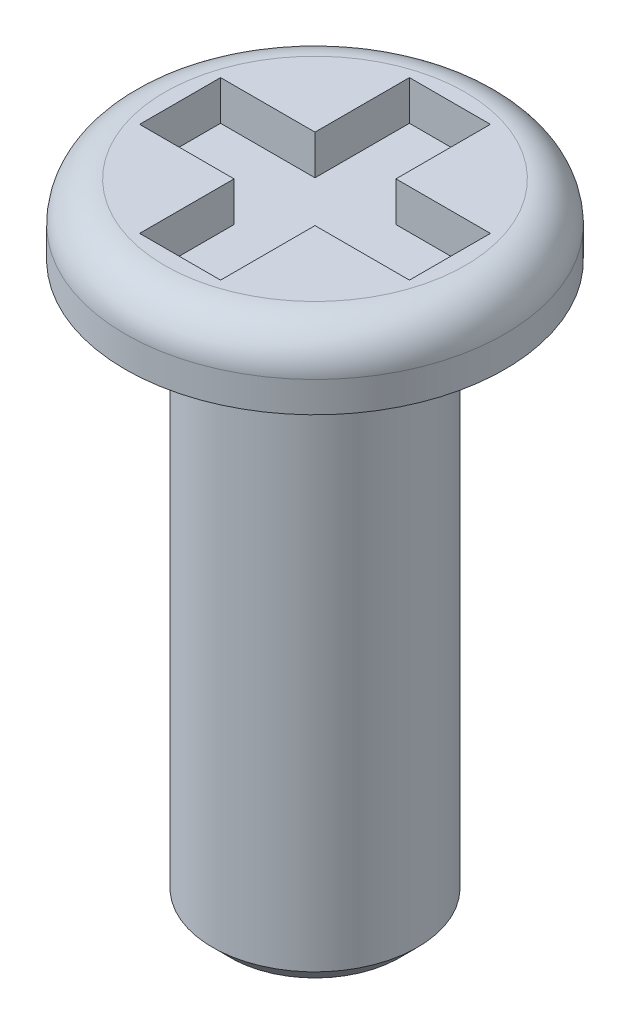
ISO-10303-21;
HEADER;
FILE_DESCRIPTION(('STEP AP214'),'2;1');
FILE_NAME('part.step','',(''),(''),'','','');
FILE_SCHEMA(('AUTOMOTIVE_DESIGN { 1 0 10303 214 1 1 1 1 }'));
ENDSEC;
DATA;
#1=APPLICATION_CONTEXT('core data for automotive mechanical design processes');
#2=APPLICATION_PROTOCOL_DEFINITION('international standard','automotive_design',2000,#1);
#3=PRODUCT_CONTEXT('',#1,'mechanical');
#4=PRODUCT('Part','Part','',(#3));
#5=PRODUCT_RELATED_PRODUCT_CATEGORY('part','',(#4));
#6=PRODUCT_DEFINITION_FORMATION('','',#4);
#7=PRODUCT_DEFINITION_CONTEXT('part definition',#1,'design');
#8=PRODUCT_DEFINITION('design','',#6,#7);
#9=PRODUCT_DEFINITION_SHAPE('','',#8);
#10=(LENGTH_UNIT() NAMED_UNIT(*) SI_UNIT(.MILLI.,.METRE.));
#11=(NAMED_UNIT(*) PLANE_ANGLE_UNIT() SI_UNIT($,.RADIAN.));
#12=(NAMED_UNIT(*) SI_UNIT($,.STERADIAN.) SOLID_ANGLE_UNIT());
#13=UNCERTAINTY_MEASURE_WITH_UNIT(LENGTH_MEASURE(1.E-05),#10,'distance_accuracy_value','');
#14=(GEOMETRIC_REPRESENTATION_CONTEXT(3) GLOBAL_UNCERTAINTY_ASSIGNED_CONTEXT((#13)) GLOBAL_UNIT_ASSIGNED_CONTEXT((#10,
#11,#12)) REPRESENTATION_CONTEXT('',''));
#15=CARTESIAN_POINT('',(0.,0.,0.));
#16=DIRECTION('',(0.,0.,1.));
#17=DIRECTION('',(1.,0.,0.));
#18=AXIS2_PLACEMENT_3D('',#15,#16,#17);
#19=CARTESIAN_POINT('',(0.,0.,0.));
#20=DIRECTION('',(0.,-1.,0.));
#21=DIRECTION('',(0.,0.,-1.));
#22=AXIS2_PLACEMENT_3D('',#19,#20,#21);
#23=PLANE('',#22);
#24=CARTESIAN_POINT('',(0.,0.,0.));
#25=DIRECTION('',(0.,-1.,0.));
#26=DIRECTION('',(0.,0.,-1.));
#27=AXIS2_PLACEMENT_3D('',#24,#25,#26);
#28=CIRCLE('',#27,1.7018);
#29=CARTESIAN_POINT('',(0.,0.,-1.7018));
#30=VERTEX_POINT('',#29);
#31=EDGE_CURVE('E218',#30,#30,#28,.F.);
#32=ORIENTED_EDGE('',*,*,#31,.T.);
#33=EDGE_LOOP('',(#32));
#34=FACE_BOUND('',#33,.T.);
#35=CARTESIAN_POINT('',(0.,0.,0.));
#36=DIRECTION('',(0.,-1.,0.));
#37=DIRECTION('',(0.,0.,-1.));
#38=AXIS2_PLACEMENT_3D('',#35,#36,#37);
#39=CIRCLE('',#38,2.6797);
#40=CARTESIAN_POINT('',(0.,0.,-2.6797));
#41=VERTEX_POINT('',#40);
#42=EDGE_CURVE('E189',#41,#41,#39,.T.);
#43=ORIENTED_EDGE('',*,*,#42,.T.);
#44=EDGE_LOOP('',(#43));
#45=FACE_BOUND('',#44,.T.);
#46=ADVANCED_FACE('F33',(#34,#45),#23,.T.);
#47=CARTESIAN_POINT('',(0.,0.9906,0.));
#48=DIRECTION('',(0.,-1.,0.));
#49=DIRECTION('',(0.,0.,-1.));
#50=AXIS2_PLACEMENT_3D('',#47,#48,#49);
#51=CYLINDRICAL_SURFACE('',#50,2.6797);
#52=CARTESIAN_POINT('',(0.,0.4318,0.));
#53=DIRECTION('',(0.,1.,0.));
#54=DIRECTION('',(0.,0.,1.));
#55=AXIS2_PLACEMENT_3D('',#52,#53,#54);
#56=CIRCLE('',#55,2.6797);
#57=CARTESIAN_POINT('',(0.,0.4318,2.6797));
#58=VERTEX_POINT('',#57);
#59=EDGE_CURVE('E41',#58,#58,#56,.F.);
#60=ORIENTED_EDGE('',*,*,#59,.T.);
#61=EDGE_LOOP('',(#60));
#62=FACE_BOUND('',#61,.T.);
#63=ORIENTED_EDGE('',*,*,#42,.F.);
#64=EDGE_LOOP('',(#63));
#65=FACE_BOUND('',#64,.T.);
#66=ADVANCED_FACE('F223',(#62,#65),#51,.T.);
#67=CARTESIAN_POINT('',(2.6797,0.9906,0.));
#68=DIRECTION('',(0.,1.,0.));
#69=DIRECTION('',(0.,0.,1.));
#70=AXIS2_PLACEMENT_3D('',#67,#68,#69);
#71=PLANE('',#70);
#72=CARTESIAN_POINT('',(0.,0.9906,0.));
#73=DIRECTION('',(0.,1.,0.));
#74=DIRECTION('',(0.,0.,1.));
#75=AXIS2_PLACEMENT_3D('',#72,#73,#74);
#76=CIRCLE('',#75,2.1209);
#77=CARTESIAN_POINT('',(0.,0.9906,2.1209));
#78=VERTEX_POINT('',#77);
#79=EDGE_CURVE('E11',#78,#78,#76,.T.);
#80=ORIENTED_EDGE('',*,*,#79,.T.);
#81=EDGE_LOOP('',(#80));
#82=FACE_BOUND('',#81,.T.);
#83=DIRECTION('',(-1.,0.,0.));
#84=VECTOR('',#83,1.);
#85=CARTESIAN_POINT('',(1.905,0.9906,-0.5715));
#86=LINE('',#85,#84);
#87=CARTESIAN_POINT('',(1.905,0.9906,-0.5715));
#88=VERTEX_POINT('',#87);
#89=CARTESIAN_POINT('',(0.5715,0.9906,-0.5715));
#90=VERTEX_POINT('',#89);
#91=EDGE_CURVE('E48',#88,#90,#86,.T.);
#92=ORIENTED_EDGE('',*,*,#91,.F.);
#93=DIRECTION('',(0.,0.,-1.));
#94=VECTOR('',#93,1.);
#95=CARTESIAN_POINT('',(1.905,0.9906,0.5715));
#96=LINE('',#95,#94);
#97=CARTESIAN_POINT('',(1.905,0.9906,0.5715));
#98=VERTEX_POINT('',#97);
#99=EDGE_CURVE('E185',#98,#88,#96,.T.);
#100=ORIENTED_EDGE('',*,*,#99,.F.);
#101=DIRECTION('',(1.,0.,0.));
#102=VECTOR('',#101,1.);
#103=CARTESIAN_POINT('',(0.5715,0.9906,0.5715));
#104=LINE('',#103,#102);
#105=CARTESIAN_POINT('',(0.5715,0.9906,0.5715));
#106=VERTEX_POINT('',#105);
#107=EDGE_CURVE('E183',#106,#98,#104,.T.);
#108=ORIENTED_EDGE('',*,*,#107,.F.);
#109=DIRECTION('',(0.,0.,-1.));
#110=VECTOR('',#109,1.);
#111=CARTESIAN_POINT('',(0.5715,0.9906,1.905));
#112=LINE('',#111,#110);
#113=CARTESIAN_POINT('',(0.5715,0.9906,1.905));
#114=VERTEX_POINT('',#113);
#115=EDGE_CURVE('E132',#114,#106,#112,.T.);
#116=ORIENTED_EDGE('',*,*,#115,.F.);
#117=DIRECTION('',(1.,0.,0.));
#118=VECTOR('',#117,1.);
#119=CARTESIAN_POINT('',(-0.5715,0.9906,1.905));
#120=LINE('',#119,#118);
#121=CARTESIAN_POINT('',(-0.5715,0.9906,1.905));
#122=VERTEX_POINT('',#121);
#123=EDGE_CURVE('E179',#122,#114,#120,.T.);
#124=ORIENTED_EDGE('',*,*,#123,.F.);
#125=DIRECTION('',(0.,0.,1.));
#126=VECTOR('',#125,1.);
#127=CARTESIAN_POINT('',(-0.5715,0.9906,0.5715));
#128=LINE('',#127,#126);
#129=CARTESIAN_POINT('',(-0.5715,0.9906,0.5715));
#130=VERTEX_POINT('',#129);
#131=EDGE_CURVE('E176',#130,#122,#128,.T.);
#132=ORIENTED_EDGE('',*,*,#131,.F.);
#133=DIRECTION('',(1.,0.,0.));
#134=VECTOR('',#133,1.);
#135=CARTESIAN_POINT('',(-1.905,0.9906,0.5715));
#136=LINE('',#135,#134);
#137=CARTESIAN_POINT('',(-1.905,0.9906,0.5715));
#138=VERTEX_POINT('',#137);
#139=EDGE_CURVE('E173',#138,#130,#136,.T.);
#140=ORIENTED_EDGE('',*,*,#139,.F.);
#141=DIRECTION('',(0.,0.,1.));
#142=VECTOR('',#141,1.);
#143=CARTESIAN_POINT('',(-1.905,0.9906,-0.5715));
#144=LINE('',#143,#142);
#145=CARTESIAN_POINT('',(-1.905,0.9906,-0.5715));
#146=VERTEX_POINT('',#145);
#147=EDGE_CURVE('E170',#146,#138,#144,.T.);
#148=ORIENTED_EDGE('',*,*,#147,.F.);
#149=DIRECTION('',(-1.,0.,0.));
#150=VECTOR('',#149,1.);
#151=CARTESIAN_POINT('',(-0.5715,0.9906,-0.5715));
#152=LINE('',#151,#150);
#153=CARTESIAN_POINT('',(-0.5715,0.9906,-0.5715));
#154=VERTEX_POINT('',#153);
#155=EDGE_CURVE('E167',#154,#146,#152,.T.);
#156=ORIENTED_EDGE('',*,*,#155,.F.);
#157=DIRECTION('',(0.,0.,1.));
#158=VECTOR('',#157,1.);
#159=CARTESIAN_POINT('',(-0.5715,0.9906,-1.905));
#160=LINE('',#159,#158);
#161=CARTESIAN_POINT('',(-0.5715,0.9906,-1.905));
#162=VERTEX_POINT('',#161);
#163=EDGE_CURVE('E164',#162,#154,#160,.T.);
#164=ORIENTED_EDGE('',*,*,#163,.F.);
#165=DIRECTION('',(-1.,0.,0.));
#166=VECTOR('',#165,1.);
#167=CARTESIAN_POINT('',(0.5715,0.9906,-1.905));
#168=LINE('',#167,#166);
#169=CARTESIAN_POINT('',(0.5715,0.9906,-1.905));
#170=VERTEX_POINT('',#169);
#171=EDGE_CURVE('E161',#170,#162,#168,.T.);
#172=ORIENTED_EDGE('',*,*,#171,.F.);
#173=DIRECTION('',(0.,0.,-1.));
#174=VECTOR('',#173,1.);
#175=CARTESIAN_POINT('',(0.5715,0.9906,-0.5715));
#176=LINE('',#175,#174);
#177=EDGE_CURVE('E158',#90,#170,#176,.T.);
#178=ORIENTED_EDGE('',*,*,#177,.F.);
#179=EDGE_LOOP('',(#92,#100,#108,#116,#124,#132,#140,#148,#156,#164,#172,#178));
#180=FACE_BOUND('',#179,.T.);
#181=ADVANCED_FACE('F241',(#82,#180),#71,.T.);
#182=CARTESIAN_POINT('',(0.,-7.9375,0.));
#183=DIRECTION('',(0.,1.,0.));
#184=DIRECTION('',(0.,0.,1.));
#185=AXIS2_PLACEMENT_3D('',#182,#183,#184);
#186=CYLINDRICAL_SURFACE('',#185,1.4478);
#187=CARTESIAN_POINT('',(0.,-0.254,0.));
#188=DIRECTION('',(0.,-1.,0.));
#189=DIRECTION('',(0.,0.,-1.));
#190=AXIS2_PLACEMENT_3D('',#187,#188,#189);
#191=CIRCLE('',#190,1.4478);
#192=CARTESIAN_POINT('',(0.,-0.254,-1.4478));
#193=VERTEX_POINT('',#192);
#194=EDGE_CURVE('E215',#193,#193,#191,.T.);
#195=ORIENTED_EDGE('',*,*,#194,.T.);
#196=EDGE_LOOP('',(#195));
#197=FACE_BOUND('',#196,.T.);
#198=CARTESIAN_POINT('',(0.,-7.68350000007714,0.));
#199=DIRECTION('',(0.,-1.,0.));
#200=DIRECTION('',(0.,0.,-1.));
#201=AXIS2_PLACEMENT_3D('',#198,#199,#200);
#202=CIRCLE('',#201,1.4478);
#203=CARTESIAN_POINT('',(0.,-7.68350000007714,-1.4478));
#204=VERTEX_POINT('',#203);
#205=EDGE_CURVE('E212',#204,#204,#202,.F.);
#206=ORIENTED_EDGE('',*,*,#205,.T.);
#207=EDGE_LOOP('',(#206));
#208=FACE_BOUND('',#207,.T.);
#209=ADVANCED_FACE('F246',(#197,#208),#186,.T.);
#210=CARTESIAN_POINT('',(0.,-7.9375,0.));
#211=DIRECTION('',(0.,-1.,0.));
#212=DIRECTION('',(0.,0.,-1.));
#213=AXIS2_PLACEMENT_3D('',#210,#211,#212);
#214=PLANE('',#213);
#215=CARTESIAN_POINT('',(0.,-7.9375,0.));
#216=DIRECTION('',(0.,-1.,0.));
#217=DIRECTION('',(0.,0.,-1.));
#218=AXIS2_PLACEMENT_3D('',#215,#216,#217);
#219=CIRCLE('',#218,1.19380000007714);
#220=CARTESIAN_POINT('',(0.,-7.9375,-1.19380000007714));
#221=VERTEX_POINT('',#220);
#222=EDGE_CURVE('E209',#221,#221,#219,.T.);
#223=ORIENTED_EDGE('',*,*,#222,.T.);
#224=EDGE_LOOP('',(#223));
#225=FACE_BOUND('',#224,.T.);
#226=ADVANCED_FACE('F262',(#225),#214,.T.);
#227=CARTESIAN_POINT('',(1.905,0.4318,-0.5715));
#228=DIRECTION('',(0.,0.,-1.));
#229=DIRECTION('',(-1.,0.,0.));
#230=AXIS2_PLACEMENT_3D('',#227,#228,#229);
#231=PLANE('',#230);
#232=ORIENTED_EDGE('',*,*,#91,.T.);
#233=DIRECTION('',(0.,1.,0.));
#234=VECTOR('',#233,1.);
#235=CARTESIAN_POINT('',(0.5715,0.4318,-0.5715));
#236=LINE('',#235,#234);
#237=CARTESIAN_POINT('',(0.5715,0.4318,-0.5715));
#238=VERTEX_POINT('',#237);
#239=EDGE_CURVE('E96',#238,#90,#236,.T.);
#240=ORIENTED_EDGE('',*,*,#239,.F.);
#241=DIRECTION('',(-1.,0.,0.));
#242=VECTOR('',#241,1.);
#243=CARTESIAN_POINT('',(1.905,0.4318,-0.5715));
#244=LINE('',#243,#242);
#245=CARTESIAN_POINT('',(1.905,0.4318,-0.5715));
#246=VERTEX_POINT('',#245);
#247=EDGE_CURVE('E187',#246,#238,#244,.T.);
#248=ORIENTED_EDGE('',*,*,#247,.F.);
#249=DIRECTION('',(0.,1.,0.));
#250=VECTOR('',#249,1.);
#251=CARTESIAN_POINT('',(1.905,0.4318,-0.5715));
#252=LINE('',#251,#250);
#253=EDGE_CURVE('E56',#246,#88,#252,.T.);
#254=ORIENTED_EDGE('',*,*,#253,.T.);
#255=EDGE_LOOP('',(#232,#240,#248,#254));
#256=FACE_BOUND('',#255,.T.);
#257=ADVANCED_FACE('F264',(#256),#231,.F.);
#258=CARTESIAN_POINT('',(1.905,0.4318,0.5715));
#259=DIRECTION('',(1.,0.,0.));
#260=DIRECTION('',(0.,0.,-1.));
#261=AXIS2_PLACEMENT_3D('',#258,#259,#260);
#262=PLANE('',#261);
#263=ORIENTED_EDGE('',*,*,#99,.T.);
#264=ORIENTED_EDGE('',*,*,#253,.F.);
#265=DIRECTION('',(0.,0.,-1.));
#266=VECTOR('',#265,1.);
#267=CARTESIAN_POINT('',(1.905,0.4318,0.5715));
#268=LINE('',#267,#266);
#269=CARTESIAN_POINT('',(1.905,0.4318,0.5715));
#270=VERTEX_POINT('',#269);
#271=EDGE_CURVE('E144',#270,#246,#268,.T.);
#272=ORIENTED_EDGE('',*,*,#271,.F.);
#273=DIRECTION('',(0.,1.,0.));
#274=VECTOR('',#273,1.);
#275=CARTESIAN_POINT('',(1.905,0.4318,0.5715));
#276=LINE('',#275,#274);
#277=EDGE_CURVE('E136',#270,#98,#276,.T.);
#278=ORIENTED_EDGE('',*,*,#277,.T.);
#279=EDGE_LOOP('',(#263,#264,#272,#278));
#280=FACE_BOUND('',#279,.T.);
#281=ADVANCED_FACE('F269',(#280),#262,.F.);
#282=CARTESIAN_POINT('',(0.5715,0.4318,0.5715));
#283=DIRECTION('',(0.,0.,1.));
#284=DIRECTION('',(1.,0.,0.));
#285=AXIS2_PLACEMENT_3D('',#282,#283,#284);
#286=PLANE('',#285);
#287=ORIENTED_EDGE('',*,*,#107,.T.);
#288=ORIENTED_EDGE('',*,*,#277,.F.);
#289=DIRECTION('',(1.,0.,0.));
#290=VECTOR('',#289,1.);
#291=CARTESIAN_POINT('',(0.5715,0.4318,0.5715));
#292=LINE('',#291,#290);
#293=CARTESIAN_POINT('',(0.5715,0.4318,0.5715));
#294=VERTEX_POINT('',#293);
#295=EDGE_CURVE('E140',#294,#270,#292,.T.);
#296=ORIENTED_EDGE('',*,*,#295,.F.);
#297=DIRECTION('',(0.,1.,0.));
#298=VECTOR('',#297,1.);
#299=CARTESIAN_POINT('',(0.5715,0.4318,0.5715));
#300=LINE('',#299,#298);
#301=EDGE_CURVE('E125',#294,#106,#300,.T.);
#302=ORIENTED_EDGE('',*,*,#301,.T.);
#303=EDGE_LOOP('',(#287,#288,#296,#302));
#304=FACE_BOUND('',#303,.T.);
#305=ADVANCED_FACE('F141',(#304),#286,.F.);
#306=CARTESIAN_POINT('',(0.5715,0.4318,1.905));
#307=DIRECTION('',(1.,0.,0.));
#308=DIRECTION('',(0.,0.,-1.));
#309=AXIS2_PLACEMENT_3D('',#306,#307,#308);
#310=PLANE('',#309);
#311=ORIENTED_EDGE('',*,*,#115,.T.);
#312=ORIENTED_EDGE('',*,*,#301,.F.);
#313=DIRECTION('',(0.,0.,-1.));
#314=VECTOR('',#313,1.);
#315=CARTESIAN_POINT('',(0.5715,0.4318,1.905));
#316=LINE('',#315,#314);
#317=CARTESIAN_POINT('',(0.5715,0.4318,1.905));
#318=VERTEX_POINT('',#317);
#319=EDGE_CURVE('E129',#318,#294,#316,.T.);
#320=ORIENTED_EDGE('',*,*,#319,.F.);
#321=DIRECTION('',(0.,1.,0.));
#322=VECTOR('',#321,1.);
#323=CARTESIAN_POINT('',(0.5715,0.4318,1.905));
#324=LINE('',#323,#322);
#325=EDGE_CURVE('E137',#318,#114,#324,.T.);
#326=ORIENTED_EDGE('',*,*,#325,.T.);
#327=EDGE_LOOP('',(#311,#312,#320,#326));
#328=FACE_BOUND('',#327,.T.);
#329=ADVANCED_FACE('F127',(#328),#310,.F.);
#330=CARTESIAN_POINT('',(-0.5715,0.4318,1.905));
#331=DIRECTION('',(0.,0.,1.));
#332=DIRECTION('',(1.,0.,0.));
#333=AXIS2_PLACEMENT_3D('',#330,#331,#332);
#334=PLANE('',#333);
#335=ORIENTED_EDGE('',*,*,#123,.T.);
#336=ORIENTED_EDGE('',*,*,#325,.F.);
#337=DIRECTION('',(1.,0.,0.));
#338=VECTOR('',#337,1.);
#339=CARTESIAN_POINT('',(-0.5715,0.4318,1.905));
#340=LINE('',#339,#338);
#341=CARTESIAN_POINT('',(-0.5715,0.4318,1.905));
#342=VERTEX_POINT('',#341);
#343=EDGE_CURVE('E150',#342,#318,#340,.T.);
#344=ORIENTED_EDGE('',*,*,#343,.F.);
#345=DIRECTION('',(0.,1.,0.));
#346=VECTOR('',#345,1.);
#347=CARTESIAN_POINT('',(-0.5715,0.4318,1.905));
#348=LINE('',#347,#346);
#349=EDGE_CURVE('E192',#342,#122,#348,.T.);
#350=ORIENTED_EDGE('',*,*,#349,.T.);
#351=EDGE_LOOP('',(#335,#336,#344,#350));
#352=FACE_BOUND('',#351,.T.);
#353=ADVANCED_FACE('F299',(#352),#334,.F.);
#354=CARTESIAN_POINT('',(-0.5715,0.4318,0.5715));
#355=DIRECTION('',(-1.,0.,0.));
#356=DIRECTION('',(0.,0.,1.));
#357=AXIS2_PLACEMENT_3D('',#354,#355,#356);
#358=PLANE('',#357);
#359=ORIENTED_EDGE('',*,*,#131,.T.);
#360=ORIENTED_EDGE('',*,*,#349,.F.);
#361=DIRECTION('',(0.,0.,1.));
#362=VECTOR('',#361,1.);
#363=CARTESIAN_POINT('',(-0.5715,0.4318,0.5715));
#364=LINE('',#363,#362);
#365=CARTESIAN_POINT('',(-0.5715,0.4318,0.5715));
#366=VERTEX_POINT('',#365);
#367=EDGE_CURVE('E152',#366,#342,#364,.T.);
#368=ORIENTED_EDGE('',*,*,#367,.F.);
#369=DIRECTION('',(0.,1.,0.));
#370=VECTOR('',#369,1.);
#371=CARTESIAN_POINT('',(-0.5715,0.4318,0.5715));
#372=LINE('',#371,#370);
#373=EDGE_CURVE('E194',#366,#130,#372,.T.);
#374=ORIENTED_EDGE('',*,*,#373,.T.);
#375=EDGE_LOOP('',(#359,#360,#368,#374));
#376=FACE_BOUND('',#375,.T.);
#377=ADVANCED_FACE('F295',(#376),#358,.F.);
#378=CARTESIAN_POINT('',(-1.905,0.4318,0.5715));
#379=DIRECTION('',(0.,0.,1.));
#380=DIRECTION('',(1.,0.,0.));
#381=AXIS2_PLACEMENT_3D('',#378,#379,#380);
#382=PLANE('',#381);
#383=ORIENTED_EDGE('',*,*,#139,.T.);
#384=ORIENTED_EDGE('',*,*,#373,.F.);
#385=DIRECTION('',(1.,0.,0.));
#386=VECTOR('',#385,1.);
#387=CARTESIAN_POINT('',(-1.905,0.4318,0.5715));
#388=LINE('',#387,#386);
#389=CARTESIAN_POINT('',(-1.905,0.4318,0.5715));
#390=VERTEX_POINT('',#389);
#391=EDGE_CURVE('E334',#390,#366,#388,.T.);
#392=ORIENTED_EDGE('',*,*,#391,.F.);
#393=DIRECTION('',(0.,1.,0.));
#394=VECTOR('',#393,1.);
#395=CARTESIAN_POINT('',(-1.905,0.4318,0.5715));
#396=LINE('',#395,#394);
#397=EDGE_CURVE('E196',#390,#138,#396,.T.);
#398=ORIENTED_EDGE('',*,*,#397,.T.);
#399=EDGE_LOOP('',(#383,#384,#392,#398));
#400=FACE_BOUND('',#399,.T.);
#401=ADVANCED_FACE('F291',(#400),#382,.F.);
#402=CARTESIAN_POINT('',(-1.905,0.4318,-0.5715));
#403=DIRECTION('',(-1.,0.,0.));
#404=DIRECTION('',(0.,0.,1.));
#405=AXIS2_PLACEMENT_3D('',#402,#403,#404);
#406=PLANE('',#405);
#407=ORIENTED_EDGE('',*,*,#147,.T.);
#408=ORIENTED_EDGE('',*,*,#397,.F.);
#409=DIRECTION('',(0.,0.,1.));
#410=VECTOR('',#409,1.);
#411=CARTESIAN_POINT('',(-1.905,0.4318,-0.5715));
#412=LINE('',#411,#410);
#413=CARTESIAN_POINT('',(-1.905,0.4318,-0.5715));
#414=VERTEX_POINT('',#413);
#415=EDGE_CURVE('E331',#414,#390,#412,.T.);
#416=ORIENTED_EDGE('',*,*,#415,.F.);
#417=DIRECTION('',(0.,1.,0.));
#418=VECTOR('',#417,1.);
#419=CARTESIAN_POINT('',(-1.905,0.4318,-0.5715));
#420=LINE('',#419,#418);
#421=EDGE_CURVE('E198',#414,#146,#420,.T.);
#422=ORIENTED_EDGE('',*,*,#421,.T.);
#423=EDGE_LOOP('',(#407,#408,#416,#422));
#424=FACE_BOUND('',#423,.T.);
#425=ADVANCED_FACE('F287',(#424),#406,.F.);
#426=CARTESIAN_POINT('',(-0.5715,0.4318,-0.5715));
#427=DIRECTION('',(0.,0.,-1.));
#428=DIRECTION('',(-1.,0.,0.));
#429=AXIS2_PLACEMENT_3D('',#426,#427,#428);
#430=PLANE('',#429);
#431=ORIENTED_EDGE('',*,*,#155,.T.);
#432=ORIENTED_EDGE('',*,*,#421,.F.);
#433=DIRECTION('',(-1.,0.,0.));
#434=VECTOR('',#433,1.);
#435=CARTESIAN_POINT('',(-0.5715,0.4318,-0.5715));
#436=LINE('',#435,#434);
#437=CARTESIAN_POINT('',(-0.5715,0.4318,-0.5715));
#438=VERTEX_POINT('',#437);
#439=EDGE_CURVE('E328',#438,#414,#436,.T.);
#440=ORIENTED_EDGE('',*,*,#439,.F.);
#441=DIRECTION('',(0.,1.,0.));
#442=VECTOR('',#441,1.);
#443=CARTESIAN_POINT('',(-0.5715,0.4318,-0.5715));
#444=LINE('',#443,#442);
#445=EDGE_CURVE('E200',#438,#154,#444,.T.);
#446=ORIENTED_EDGE('',*,*,#445,.T.);
#447=EDGE_LOOP('',(#431,#432,#440,#446));
#448=FACE_BOUND('',#447,.T.);
#449=ADVANCED_FACE('F283',(#448),#430,.F.);
#450=CARTESIAN_POINT('',(-0.5715,0.4318,-1.905));
#451=DIRECTION('',(-1.,0.,0.));
#452=DIRECTION('',(0.,0.,1.));
#453=AXIS2_PLACEMENT_3D('',#450,#451,#452);
#454=PLANE('',#453);
#455=ORIENTED_EDGE('',*,*,#163,.T.);
#456=ORIENTED_EDGE('',*,*,#445,.F.);
#457=DIRECTION('',(0.,0.,1.));
#458=VECTOR('',#457,1.);
#459=CARTESIAN_POINT('',(-0.5715,0.4318,-1.905));
#460=LINE('',#459,#458);
#461=CARTESIAN_POINT('',(-0.5715,0.4318,-1.905));
#462=VERTEX_POINT('',#461);
#463=EDGE_CURVE('E325',#462,#438,#460,.T.);
#464=ORIENTED_EDGE('',*,*,#463,.F.);
#465=DIRECTION('',(0.,1.,0.));
#466=VECTOR('',#465,1.);
#467=CARTESIAN_POINT('',(-0.5715,0.4318,-1.905));
#468=LINE('',#467,#466);
#469=EDGE_CURVE('E202',#462,#162,#468,.T.);
#470=ORIENTED_EDGE('',*,*,#469,.T.);
#471=EDGE_LOOP('',(#455,#456,#464,#470));
#472=FACE_BOUND('',#471,.T.);
#473=ADVANCED_FACE('F279',(#472),#454,.F.);
#474=CARTESIAN_POINT('',(0.5715,0.4318,-1.905));
#475=DIRECTION('',(0.,0.,-1.));
#476=DIRECTION('',(-1.,0.,0.));
#477=AXIS2_PLACEMENT_3D('',#474,#475,#476);
#478=PLANE('',#477);
#479=ORIENTED_EDGE('',*,*,#171,.T.);
#480=ORIENTED_EDGE('',*,*,#469,.F.);
#481=DIRECTION('',(-1.,0.,0.));
#482=VECTOR('',#481,1.);
#483=CARTESIAN_POINT('',(0.5715,0.4318,-1.905));
#484=LINE('',#483,#482);
#485=CARTESIAN_POINT('',(0.5715,0.4318,-1.905));
#486=VERTEX_POINT('',#485);
#487=EDGE_CURVE('E320',#486,#462,#484,.T.);
#488=ORIENTED_EDGE('',*,*,#487,.F.);
#489=DIRECTION('',(0.,1.,0.));
#490=VECTOR('',#489,1.);
#491=CARTESIAN_POINT('',(0.5715,0.4318,-1.905));
#492=LINE('',#491,#490);
#493=EDGE_CURVE('E204',#486,#170,#492,.T.);
#494=ORIENTED_EDGE('',*,*,#493,.T.);
#495=EDGE_LOOP('',(#479,#480,#488,#494));
#496=FACE_BOUND('',#495,.T.);
#497=ADVANCED_FACE('F275',(#496),#478,.F.);
#498=CARTESIAN_POINT('',(0.5715,0.4318,-0.5715));
#499=DIRECTION('',(1.,0.,0.));
#500=DIRECTION('',(0.,0.,-1.));
#501=AXIS2_PLACEMENT_3D('',#498,#499,#500);
#502=PLANE('',#501);
#503=ORIENTED_EDGE('',*,*,#177,.T.);
#504=ORIENTED_EDGE('',*,*,#493,.F.);
#505=DIRECTION('',(0.,0.,-1.));
#506=VECTOR('',#505,1.);
#507=CARTESIAN_POINT('',(0.5715,0.4318,-0.5715));
#508=LINE('',#507,#506);
#509=EDGE_CURVE('E318',#238,#486,#508,.T.);
#510=ORIENTED_EDGE('',*,*,#509,.F.);
#511=ORIENTED_EDGE('',*,*,#239,.T.);
#512=EDGE_LOOP('',(#503,#504,#510,#511));
#513=FACE_BOUND('',#512,.T.);
#514=ADVANCED_FACE('F256',(#513),#502,.F.);
#515=CARTESIAN_POINT('',(0.,0.4318,0.));
#516=DIRECTION('',(0.,-1.,0.));
#517=DIRECTION('',(0.,0.,-1.));
#518=AXIS2_PLACEMENT_3D('',#515,#516,#517);
#519=PLANE('',#518);
#520=ORIENTED_EDGE('',*,*,#247,.T.);
#521=ORIENTED_EDGE('',*,*,#509,.T.);
#522=ORIENTED_EDGE('',*,*,#487,.T.);
#523=ORIENTED_EDGE('',*,*,#463,.T.);
#524=ORIENTED_EDGE('',*,*,#439,.T.);
#525=ORIENTED_EDGE('',*,*,#415,.T.);
#526=ORIENTED_EDGE('',*,*,#391,.T.);
#527=ORIENTED_EDGE('',*,*,#367,.T.);
#528=ORIENTED_EDGE('',*,*,#343,.T.);
#529=ORIENTED_EDGE('',*,*,#319,.T.);
#530=ORIENTED_EDGE('',*,*,#295,.T.);
#531=ORIENTED_EDGE('',*,*,#271,.T.);
#532=EDGE_LOOP('',(#520,#521,#522,#523,#524,#525,#526,#527,#528,#529,#530,#531));
#533=FACE_BOUND('',#532,.T.);
#534=ADVANCED_FACE('F147',(#533),#519,.F.);
#535=CARTESIAN_POINT('',(0.,-7.9375,0.));
#536=DIRECTION('',(0.,1.,0.));
#537=DIRECTION('',(0.,0.,1.));
#538=AXIS2_PLACEMENT_3D('',#535,#536,#537);
#539=CONICAL_SURFACE('',#538,1.19380000007714,0.785398163397445);
#540=ORIENTED_EDGE('',*,*,#205,.F.);
#541=EDGE_LOOP('',(#540));
#542=FACE_BOUND('',#541,.T.);
#543=ORIENTED_EDGE('',*,*,#222,.F.);
#544=EDGE_LOOP('',(#543));
#545=FACE_BOUND('',#544,.T.);
#546=ADVANCED_FACE('F232',(#542,#545),#539,.T.);
#547=CARTESIAN_POINT('',(0.,-0.254,0.));
#548=DIRECTION('',(0.,-1.,0.));
#549=DIRECTION('',(0.,0.,-1.));
#550=AXIS2_PLACEMENT_3D('',#547,#548,#549);
#551=TOROIDAL_SURFACE('',#550,1.7018,0.254);
#552=ORIENTED_EDGE('',*,*,#31,.F.);
#553=EDGE_LOOP('',(#552));
#554=FACE_BOUND('',#553,.T.);
#555=ORIENTED_EDGE('',*,*,#194,.F.);
#556=EDGE_LOOP('',(#555));
#557=FACE_BOUND('',#556,.T.);
#558=ADVANCED_FACE('F227',(#554,#557),#551,.F.);
#559=CARTESIAN_POINT('',(0.,0.4318,0.));
#560=DIRECTION('',(0.,1.,0.));
#561=DIRECTION('',(0.,0.,1.));
#562=AXIS2_PLACEMENT_3D('',#559,#560,#561);
#563=TOROIDAL_SURFACE('',#562,2.1209,0.5588);
#564=ORIENTED_EDGE('',*,*,#79,.F.);
#565=EDGE_LOOP('',(#564));
#566=FACE_BOUND('',#565,.T.);
#567=ORIENTED_EDGE('',*,*,#59,.F.);
#568=EDGE_LOOP('',(#567));
#569=FACE_BOUND('',#568,.T.);
#570=ADVANCED_FACE('F35',(#566,#569),#563,.T.);
#571=CLOSED_SHELL('',(#46,#66,#181,#209,#226,#257,#281,#305,#329,#353,#377,#401,#425,#449,#473,
#497,#514,#534,#546,#558,#570));
#572=MANIFOLD_SOLID_BREP('B2',#571);
#573=ADVANCED_BREP_SHAPE_REPRESENTATION('',(#18,#572),#14);
#574=SHAPE_DEFINITION_REPRESENTATION(#9,#573);
ENDSEC;
END-ISO-10303-21;
